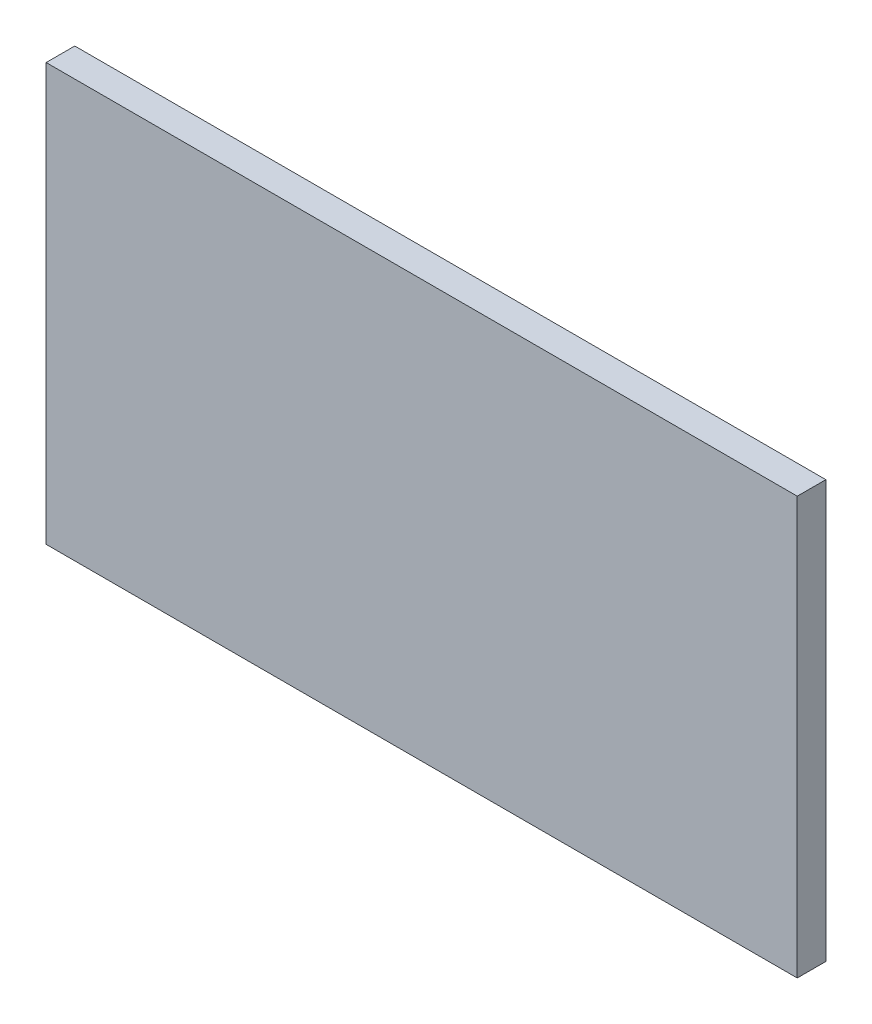
ISO-10303-21;
HEADER;
FILE_DESCRIPTION(('STEP AP214'),'2;1');
FILE_NAME('part.step','',(''),(''),'','','');
FILE_SCHEMA(('AUTOMOTIVE_DESIGN { 1 0 10303 214 1 1 1 1 }'));
ENDSEC;
DATA;
#1=APPLICATION_CONTEXT('core data for automotive mechanical design processes');
#2=APPLICATION_PROTOCOL_DEFINITION('international standard','automotive_design',2000,#1);
#3=PRODUCT_CONTEXT('',#1,'mechanical');
#4=PRODUCT('Part','Part','',(#3));
#5=PRODUCT_RELATED_PRODUCT_CATEGORY('part','',(#4));
#6=PRODUCT_DEFINITION_FORMATION('','',#4);
#7=PRODUCT_DEFINITION_CONTEXT('part definition',#1,'design');
#8=PRODUCT_DEFINITION('design','',#6,#7);
#9=PRODUCT_DEFINITION_SHAPE('','',#8);
#10=(LENGTH_UNIT() NAMED_UNIT(*) SI_UNIT(.MILLI.,.METRE.));
#11=(NAMED_UNIT(*) PLANE_ANGLE_UNIT() SI_UNIT($,.RADIAN.));
#12=(NAMED_UNIT(*) SI_UNIT($,.STERADIAN.) SOLID_ANGLE_UNIT());
#13=UNCERTAINTY_MEASURE_WITH_UNIT(LENGTH_MEASURE(1.E-05),#10,'distance_accuracy_value','');
#14=(GEOMETRIC_REPRESENTATION_CONTEXT(3) GLOBAL_UNCERTAINTY_ASSIGNED_CONTEXT((#13)) GLOBAL_UNIT_ASSIGNED_CONTEXT((#10,
#11,#12)) REPRESENTATION_CONTEXT('',''));
#15=CARTESIAN_POINT('',(0.,0.,0.));
#16=DIRECTION('',(0.,0.,1.));
#17=DIRECTION('',(1.,0.,0.));
#18=AXIS2_PLACEMENT_3D('',#15,#16,#17);
#19=CARTESIAN_POINT('',(12.50008,1.6,0.));
#20=DIRECTION('',(0.,0.,-1.));
#21=DIRECTION('',(-1.,0.,0.));
#22=AXIS2_PLACEMENT_3D('',#19,#20,#21);
#23=PLANE('',#22);
#24=DIRECTION('',(1.,0.,0.));
#25=VECTOR('',#24,1.);
#26=CARTESIAN_POINT('',(12.05008,1.85,0.));
#27=LINE('',#26,#25);
#28=CARTESIAN_POINT('',(12.05008,1.85,0.));
#29=VERTEX_POINT('',#28);
#30=CARTESIAN_POINT('',(12.95008,1.85,0.));
#31=VERTEX_POINT('',#30);
#32=EDGE_CURVE('E55',#29,#31,#27,.T.);
#33=ORIENTED_EDGE('',*,*,#32,.T.);
#34=DIRECTION('',(0.,1.,0.));
#35=VECTOR('',#34,1.);
#36=CARTESIAN_POINT('',(12.95008,1.85,0.));
#37=LINE('',#36,#35);
#38=CARTESIAN_POINT('',(12.95008,1.35,0.));
#39=VERTEX_POINT('',#38);
#40=EDGE_CURVE('E57',#31,#39,#37,.F.);
#41=ORIENTED_EDGE('',*,*,#40,.T.);
#42=DIRECTION('',(1.,0.,0.));
#43=VECTOR('',#42,1.);
#44=CARTESIAN_POINT('',(12.95008,1.35,0.));
#45=LINE('',#44,#43);
#46=CARTESIAN_POINT('',(12.05008,1.35,0.));
#47=VERTEX_POINT('',#46);
#48=EDGE_CURVE('E20',#39,#47,#45,.F.);
#49=ORIENTED_EDGE('',*,*,#48,.T.);
#50=DIRECTION('',(0.,1.,0.));
#51=VECTOR('',#50,1.);
#52=CARTESIAN_POINT('',(12.05008,1.35,0.));
#53=LINE('',#52,#51);
#54=EDGE_CURVE('E80',#47,#29,#53,.T.);
#55=ORIENTED_EDGE('',*,*,#54,.T.);
#56=EDGE_LOOP('',(#33,#41,#49,#55));
#57=FACE_BOUND('',#56,.T.);
#58=ADVANCED_FACE('F17',(#57),#23,.T.);
#59=CARTESIAN_POINT('',(12.95008,1.35,0.));
#60=DIRECTION('',(0.,1.,0.));
#61=DIRECTION('',(0.,0.,1.));
#62=AXIS2_PLACEMENT_3D('',#59,#60,#61);
#63=PLANE('',#62);
#64=DIRECTION('',(0.,0.,-1.));
#65=VECTOR('',#64,1.);
#66=CARTESIAN_POINT('',(12.05008,1.35,0.));
#67=LINE('',#66,#65);
#68=CARTESIAN_POINT('',(12.05008,1.35,0.03429));
#69=VERTEX_POINT('',#68);
#70=EDGE_CURVE('E68',#69,#47,#67,.T.);
#71=ORIENTED_EDGE('',*,*,#70,.T.);
#72=ORIENTED_EDGE('',*,*,#48,.F.);
#73=DIRECTION('',(0.,0.,1.));
#74=VECTOR('',#73,1.);
#75=CARTESIAN_POINT('',(12.95008,1.35,0.));
#76=LINE('',#75,#74);
#77=CARTESIAN_POINT('',(12.95008,1.35,0.03429));
#78=VERTEX_POINT('',#77);
#79=EDGE_CURVE('E63',#39,#78,#76,.T.);
#80=ORIENTED_EDGE('',*,*,#79,.T.);
#81=DIRECTION('',(1.,0.,0.));
#82=VECTOR('',#81,1.);
#83=CARTESIAN_POINT('',(12.50008,1.35,0.03429));
#84=LINE('',#83,#82);
#85=EDGE_CURVE('E83',#69,#78,#84,.T.);
#86=ORIENTED_EDGE('',*,*,#85,.F.);
#87=EDGE_LOOP('',(#71,#72,#80,#86));
#88=FACE_BOUND('',#87,.T.);
#89=ADVANCED_FACE('F65',(#88),#63,.F.);
#90=CARTESIAN_POINT('',(12.95008,1.85,0.));
#91=DIRECTION('',(-1.,0.,0.));
#92=DIRECTION('',(0.,0.,1.));
#93=AXIS2_PLACEMENT_3D('',#90,#91,#92);
#94=PLANE('',#93);
#95=ORIENTED_EDGE('',*,*,#79,.F.);
#96=ORIENTED_EDGE('',*,*,#40,.F.);
#97=DIRECTION('',(0.,0.,-1.));
#98=VECTOR('',#97,1.);
#99=CARTESIAN_POINT('',(12.95008,1.85,0.));
#100=LINE('',#99,#98);
#101=CARTESIAN_POINT('',(12.95008,1.85,0.03429));
#102=VERTEX_POINT('',#101);
#103=EDGE_CURVE('E75',#31,#102,#100,.F.);
#104=ORIENTED_EDGE('',*,*,#103,.T.);
#105=DIRECTION('',(0.,1.,0.));
#106=VECTOR('',#105,1.);
#107=CARTESIAN_POINT('',(12.95008,1.6,0.03429));
#108=LINE('',#107,#106);
#109=EDGE_CURVE('E72',#78,#102,#108,.T.);
#110=ORIENTED_EDGE('',*,*,#109,.F.);
#111=EDGE_LOOP('',(#95,#96,#104,#110));
#112=FACE_BOUND('',#111,.T.);
#113=ADVANCED_FACE('F70',(#112),#94,.F.);
#114=CARTESIAN_POINT('',(12.05008,1.85,0.));
#115=DIRECTION('',(0.,-1.,0.));
#116=DIRECTION('',(0.,0.,-1.));
#117=AXIS2_PLACEMENT_3D('',#114,#115,#116);
#118=PLANE('',#117);
#119=ORIENTED_EDGE('',*,*,#103,.F.);
#120=ORIENTED_EDGE('',*,*,#32,.F.);
#121=DIRECTION('',(0.,0.,-1.));
#122=VECTOR('',#121,1.);
#123=CARTESIAN_POINT('',(12.05008,1.85,0.));
#124=LINE('',#123,#122);
#125=CARTESIAN_POINT('',(12.05008,1.85,0.03429));
#126=VERTEX_POINT('',#125);
#127=EDGE_CURVE('E35',#29,#126,#124,.F.);
#128=ORIENTED_EDGE('',*,*,#127,.T.);
#129=DIRECTION('',(1.,0.,0.));
#130=VECTOR('',#129,1.);
#131=CARTESIAN_POINT('',(12.50008,1.85,0.03429));
#132=LINE('',#131,#130);
#133=EDGE_CURVE('E26',#102,#126,#132,.F.);
#134=ORIENTED_EDGE('',*,*,#133,.F.);
#135=EDGE_LOOP('',(#119,#120,#128,#134));
#136=FACE_BOUND('',#135,.T.);
#137=ADVANCED_FACE('F89',(#136),#118,.F.);
#138=CARTESIAN_POINT('',(12.05008,1.35,0.));
#139=DIRECTION('',(1.,0.,0.));
#140=DIRECTION('',(0.,0.,-1.));
#141=AXIS2_PLACEMENT_3D('',#138,#139,#140);
#142=PLANE('',#141);
#143=ORIENTED_EDGE('',*,*,#127,.F.);
#144=ORIENTED_EDGE('',*,*,#54,.F.);
#145=ORIENTED_EDGE('',*,*,#70,.F.);
#146=DIRECTION('',(0.,1.,0.));
#147=VECTOR('',#146,1.);
#148=CARTESIAN_POINT('',(12.05008,1.6,0.03429));
#149=LINE('',#148,#147);
#150=EDGE_CURVE('E11',#126,#69,#149,.F.);
#151=ORIENTED_EDGE('',*,*,#150,.F.);
#152=EDGE_LOOP('',(#143,#144,#145,#151));
#153=FACE_BOUND('',#152,.T.);
#154=ADVANCED_FACE('F91',(#153),#142,.F.);
#155=CARTESIAN_POINT('',(12.50008,1.6,0.03429));
#156=DIRECTION('',(0.,0.,1.));
#157=DIRECTION('',(1.,0.,0.));
#158=AXIS2_PLACEMENT_3D('',#155,#156,#157);
#159=PLANE('',#158);
#160=ORIENTED_EDGE('',*,*,#133,.T.);
#161=ORIENTED_EDGE('',*,*,#150,.T.);
#162=ORIENTED_EDGE('',*,*,#85,.T.);
#163=ORIENTED_EDGE('',*,*,#109,.T.);
#164=EDGE_LOOP('',(#160,#161,#162,#163));
#165=FACE_BOUND('',#164,.T.);
#166=ADVANCED_FACE('F88',(#165),#159,.T.);
#167=CLOSED_SHELL('',(#58,#89,#113,#137,#154,#166));
#168=MANIFOLD_SOLID_BREP('B1',#167);
#169=ADVANCED_BREP_SHAPE_REPRESENTATION('',(#18,#168),#14);
#170=SHAPE_DEFINITION_REPRESENTATION(#9,#169);
ENDSEC;
END-ISO-10303-21;
